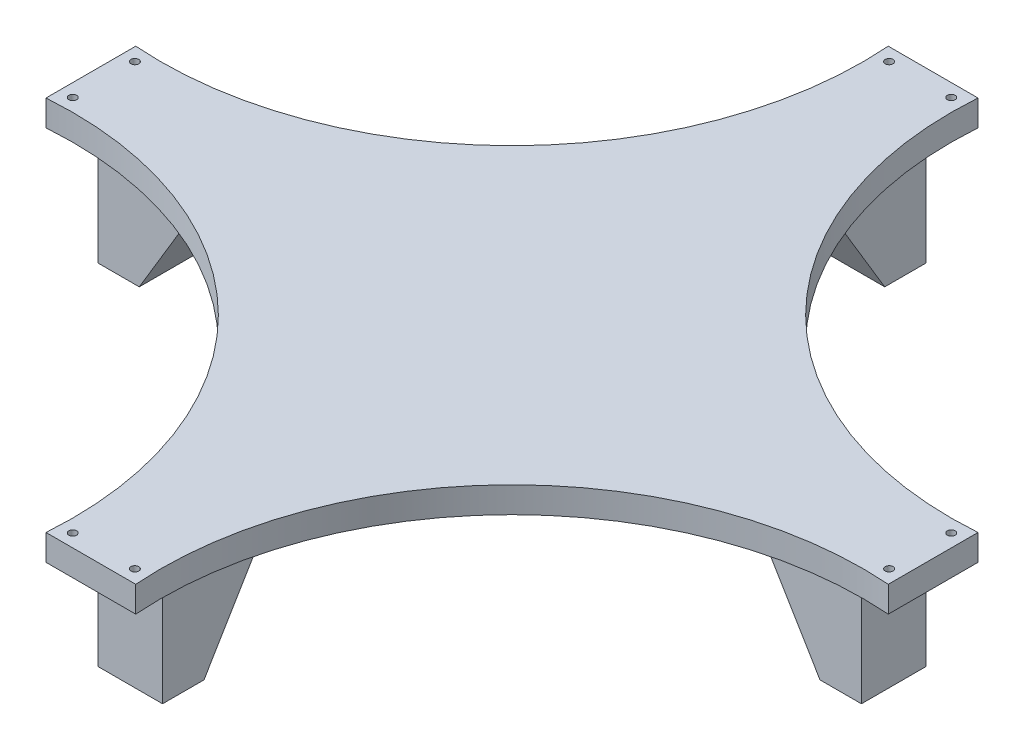
ISO-10303-21;
HEADER;
FILE_DESCRIPTION(('STEP AP214'),'2;1');
FILE_NAME('part.step','',(''),(''),'','','');
FILE_SCHEMA(('AUTOMOTIVE_DESIGN { 1 0 10303 214 1 1 1 1 }'));
ENDSEC;
DATA;
#1=APPLICATION_CONTEXT('core data for automotive mechanical design processes');
#2=APPLICATION_PROTOCOL_DEFINITION('international standard','automotive_design',2000,#1);
#3=PRODUCT_CONTEXT('',#1,'mechanical');
#4=PRODUCT('Part','Part','',(#3));
#5=PRODUCT_RELATED_PRODUCT_CATEGORY('part','',(#4));
#6=PRODUCT_DEFINITION_FORMATION('','',#4);
#7=PRODUCT_DEFINITION_CONTEXT('part definition',#1,'design');
#8=PRODUCT_DEFINITION('design','',#6,#7);
#9=PRODUCT_DEFINITION_SHAPE('','',#8);
#10=(LENGTH_UNIT() NAMED_UNIT(*) SI_UNIT(.MILLI.,.METRE.));
#11=(NAMED_UNIT(*) PLANE_ANGLE_UNIT() SI_UNIT($,.RADIAN.));
#12=(NAMED_UNIT(*) SI_UNIT($,.STERADIAN.) SOLID_ANGLE_UNIT());
#13=UNCERTAINTY_MEASURE_WITH_UNIT(LENGTH_MEASURE(1.E-05),#10,'distance_accuracy_value','');
#14=(GEOMETRIC_REPRESENTATION_CONTEXT(3) GLOBAL_UNCERTAINTY_ASSIGNED_CONTEXT((#13)) GLOBAL_UNIT_ASSIGNED_CONTEXT((#10,
#11,#12)) REPRESENTATION_CONTEXT('',''));
#15=CARTESIAN_POINT('',(0.,0.,0.));
#16=DIRECTION('',(0.,0.,1.));
#17=DIRECTION('',(1.,0.,0.));
#18=AXIS2_PLACEMENT_3D('',#15,#16,#17);
#19=CARTESIAN_POINT('',(0.,0.,0.));
#20=DIRECTION('',(0.,1.,0.));
#21=DIRECTION('',(0.,0.,1.));
#22=AXIS2_PLACEMENT_3D('',#19,#20,#21);
#23=PLANE('',#22);
#24=CARTESIAN_POINT('',(152.66,0.,-152.66));
#25=DIRECTION('',(0.,1.,0.));
#26=DIRECTION('',(0.,0.,1.));
#27=AXIS2_PLACEMENT_3D('',#24,#25,#26);
#28=CIRCLE('',#27,135.7);
#29=CARTESIAN_POINT('',(17.3289614316065,0.,-162.66));
#30=VERTEX_POINT('',#29);
#31=CARTESIAN_POINT('',(162.66,0.,-17.3289614316065));
#32=VERTEX_POINT('',#31);
#33=EDGE_CURVE('E354',#30,#32,#28,.T.);
#34=ORIENTED_EDGE('',*,*,#33,.T.);
#35=DIRECTION('',(0.,0.,1.));
#36=VECTOR('',#35,1.);
#37=CARTESIAN_POINT('',(162.66,0.,0.));
#38=LINE('',#37,#36);
#39=CARTESIAN_POINT('',(162.66,0.,17.3289614316066));
#40=VERTEX_POINT('',#39);
#41=EDGE_CURVE('E285',#32,#40,#38,.T.);
#42=ORIENTED_EDGE('',*,*,#41,.T.);
#43=CARTESIAN_POINT('',(152.66,0.,152.66));
#44=DIRECTION('',(0.,1.,0.));
#45=DIRECTION('',(0.,0.,1.));
#46=AXIS2_PLACEMENT_3D('',#43,#44,#45);
#47=CIRCLE('',#46,135.7);
#48=CARTESIAN_POINT('',(17.3289614316064,0.,162.66));
#49=VERTEX_POINT('',#48);
#50=EDGE_CURVE('E369',#40,#49,#47,.T.);
#51=ORIENTED_EDGE('',*,*,#50,.T.);
#52=DIRECTION('',(-1.,0.,0.));
#53=VECTOR('',#52,1.);
#54=CARTESIAN_POINT('',(0.,0.,162.66));
#55=LINE('',#54,#53);
#56=CARTESIAN_POINT('',(-17.3289614316066,0.,162.66));
#57=VERTEX_POINT('',#56);
#58=EDGE_CURVE('E366',#49,#57,#55,.T.);
#59=ORIENTED_EDGE('',*,*,#58,.T.);
#60=CARTESIAN_POINT('',(-152.66,0.,152.66));
#61=DIRECTION('',(0.,1.,0.));
#62=DIRECTION('',(0.,0.,1.));
#63=AXIS2_PLACEMENT_3D('',#60,#61,#62);
#64=CIRCLE('',#63,135.7);
#65=CARTESIAN_POINT('',(-162.66,0.,17.3289614316065));
#66=VERTEX_POINT('',#65);
#67=EDGE_CURVE('E364',#57,#66,#64,.T.);
#68=ORIENTED_EDGE('',*,*,#67,.T.);
#69=DIRECTION('',(0.,0.,-1.));
#70=VECTOR('',#69,1.);
#71=CARTESIAN_POINT('',(-162.66,0.,0.));
#72=LINE('',#71,#70);
#73=CARTESIAN_POINT('',(-162.66,0.,-17.3289614316065));
#74=VERTEX_POINT('',#73);
#75=EDGE_CURVE('E361',#66,#74,#72,.T.);
#76=ORIENTED_EDGE('',*,*,#75,.T.);
#77=CARTESIAN_POINT('',(-152.66,0.,-152.66));
#78=DIRECTION('',(0.,1.,0.));
#79=DIRECTION('',(0.,0.,1.));
#80=AXIS2_PLACEMENT_3D('',#77,#78,#79);
#81=CIRCLE('',#80,135.7);
#82=CARTESIAN_POINT('',(-17.3289614316066,0.,-162.66));
#83=VERTEX_POINT('',#82);
#84=EDGE_CURVE('E359',#74,#83,#81,.T.);
#85=ORIENTED_EDGE('',*,*,#84,.T.);
#86=DIRECTION('',(1.,0.,0.));
#87=VECTOR('',#86,1.);
#88=CARTESIAN_POINT('',(0.,0.,-162.66));
#89=LINE('',#88,#87);
#90=EDGE_CURVE('E356',#83,#30,#89,.T.);
#91=ORIENTED_EDGE('',*,*,#90,.T.);
#92=EDGE_LOOP('',(#34,#42,#51,#59,#68,#76,#85,#91));
#93=FACE_BOUND('',#92,.T.);
#94=DIRECTION('',(-1.,0.,0.));
#95=VECTOR('',#94,1.);
#96=CARTESIAN_POINT('',(0.,0.,-107.465698486706));
#97=LINE('',#96,#95);
#98=CARTESIAN_POINT('',(12.5000000000138,0.,-107.465698486716));
#99=VERTEX_POINT('',#98);
#100=CARTESIAN_POINT('',(-12.5000000000003,0.,-107.465698486716));
#101=VERTEX_POINT('',#100);
#102=EDGE_CURVE('E195',#99,#101,#97,.T.);
#103=ORIENTED_EDGE('',*,*,#102,.F.);
#104=DIRECTION('',(0.,0.,1.));
#105=VECTOR('',#104,1.);
#106=CARTESIAN_POINT('',(12.5000000000137,0.,0.));
#107=LINE('',#106,#105);
#108=CARTESIAN_POINT('',(12.5000000000138,0.,-147.465698486706));
#109=VERTEX_POINT('',#108);
#110=EDGE_CURVE('E204',#109,#99,#107,.T.);
#111=ORIENTED_EDGE('',*,*,#110,.F.);
#112=DIRECTION('',(-1.,0.,0.));
#113=VECTOR('',#112,1.);
#114=CARTESIAN_POINT('',(0.,0.,-147.465698486706));
#115=LINE('',#114,#113);
#116=CARTESIAN_POINT('',(-12.4999999999862,0.,-147.465698486706));
#117=VERTEX_POINT('',#116);
#118=EDGE_CURVE('E218',#109,#117,#115,.T.);
#119=ORIENTED_EDGE('',*,*,#118,.T.);
#120=DIRECTION('',(0.,0.,1.));
#121=VECTOR('',#120,1.);
#122=CARTESIAN_POINT('',(-12.4999999999863,0.,0.));
#123=LINE('',#122,#121);
#124=EDGE_CURVE('E203',#117,#101,#123,.T.);
#125=ORIENTED_EDGE('',*,*,#124,.T.);
#126=EDGE_LOOP('',(#103,#111,#119,#125));
#127=FACE_BOUND('',#126,.T.);
#128=DIRECTION('',(0.,0.,1.));
#129=VECTOR('',#128,1.);
#130=CARTESIAN_POINT('',(-107.465698486716,0.,0.));
#131=LINE('',#130,#129);
#132=CARTESIAN_POINT('',(-107.465698486716,0.,-12.5));
#133=VERTEX_POINT('',#132);
#134=CARTESIAN_POINT('',(-107.465698486716,0.,12.4999999999999));
#135=VERTEX_POINT('',#134);
#136=EDGE_CURVE('E430',#133,#135,#131,.T.);
#137=ORIENTED_EDGE('',*,*,#136,.F.);
#138=DIRECTION('',(1.,0.,0.));
#139=VECTOR('',#138,1.);
#140=CARTESIAN_POINT('',(0.,0.,-12.5));
#141=LINE('',#140,#139);
#142=CARTESIAN_POINT('',(-147.465698486716,0.,-12.5));
#143=VERTEX_POINT('',#142);
#144=EDGE_CURVE('E432',#143,#133,#141,.T.);
#145=ORIENTED_EDGE('',*,*,#144,.F.);
#146=DIRECTION('',(0.,0.,1.));
#147=VECTOR('',#146,1.);
#148=CARTESIAN_POINT('',(-147.465698486716,0.,0.));
#149=LINE('',#148,#147);
#150=CARTESIAN_POINT('',(-147.465698486716,0.,12.5));
#151=VERTEX_POINT('',#150);
#152=EDGE_CURVE('E424',#143,#151,#149,.T.);
#153=ORIENTED_EDGE('',*,*,#152,.T.);
#154=DIRECTION('',(1.,0.,0.));
#155=VECTOR('',#154,1.);
#156=CARTESIAN_POINT('',(0.,0.,12.5));
#157=LINE('',#156,#155);
#158=EDGE_CURVE('E427',#151,#135,#157,.T.);
#159=ORIENTED_EDGE('',*,*,#158,.T.);
#160=EDGE_LOOP('',(#137,#145,#153,#159));
#161=FACE_BOUND('',#160,.T.);
#162=DIRECTION('',(1.,0.,0.));
#163=VECTOR('',#162,1.);
#164=CARTESIAN_POINT('',(0.,0.,107.46569848673));
#165=LINE('',#164,#163);
#166=CARTESIAN_POINT('',(-12.5000000000107,0.,107.465698486716));
#167=VERTEX_POINT('',#166);
#168=CARTESIAN_POINT('',(12.500000000001,0.,107.465698486716));
#169=VERTEX_POINT('',#168);
#170=EDGE_CURVE('E269',#167,#169,#165,.T.);
#171=ORIENTED_EDGE('',*,*,#170,.F.);
#172=DIRECTION('',(0.,0.,-1.));
#173=VECTOR('',#172,1.);
#174=CARTESIAN_POINT('',(-12.5000000000107,0.,0.));
#175=LINE('',#174,#173);
#176=CARTESIAN_POINT('',(-12.5000000000107,0.,147.46569848673));
#177=VERTEX_POINT('',#176);
#178=EDGE_CURVE('E255',#177,#167,#175,.T.);
#179=ORIENTED_EDGE('',*,*,#178,.F.);
#180=DIRECTION('',(1.,0.,0.));
#181=VECTOR('',#180,1.);
#182=CARTESIAN_POINT('',(0.,0.,147.46569848673));
#183=LINE('',#182,#181);
#184=CARTESIAN_POINT('',(12.4999999999893,0.,147.46569848673));
#185=VERTEX_POINT('',#184);
#186=EDGE_CURVE('E260',#177,#185,#183,.T.);
#187=ORIENTED_EDGE('',*,*,#186,.T.);
#188=DIRECTION('',(0.,0.,-1.));
#189=VECTOR('',#188,1.);
#190=CARTESIAN_POINT('',(12.4999999999893,0.,0.));
#191=LINE('',#190,#189);
#192=EDGE_CURVE('E271',#185,#169,#191,.T.);
#193=ORIENTED_EDGE('',*,*,#192,.T.);
#194=EDGE_LOOP('',(#171,#179,#187,#193));
#195=FACE_BOUND('',#194,.T.);
#196=DIRECTION('',(-1.,0.,0.));
#197=VECTOR('',#196,1.);
#198=CARTESIAN_POINT('',(0.,0.,-12.4999999999999));
#199=LINE('',#198,#197);
#200=CARTESIAN_POINT('',(147.465698486716,0.,-12.4999999999999));
#201=VERTEX_POINT('',#200);
#202=CARTESIAN_POINT('',(107.465698486716,0.,-12.4999999999999));
#203=VERTEX_POINT('',#202);
#204=EDGE_CURVE('E242',#201,#203,#199,.T.);
#205=ORIENTED_EDGE('',*,*,#204,.T.);
#206=DIRECTION('',(0.,0.,1.));
#207=VECTOR('',#206,1.);
#208=CARTESIAN_POINT('',(107.465698486716,0.,0.));
#209=LINE('',#208,#207);
#210=CARTESIAN_POINT('',(107.465698486716,0.,12.5000000000001));
#211=VERTEX_POINT('',#210);
#212=EDGE_CURVE('E229',#203,#211,#209,.T.);
#213=ORIENTED_EDGE('',*,*,#212,.T.);
#214=DIRECTION('',(-1.,0.,0.));
#215=VECTOR('',#214,1.);
#216=CARTESIAN_POINT('',(0.,0.,12.5000000000001));
#217=LINE('',#216,#215);
#218=CARTESIAN_POINT('',(147.465698486716,0.,12.5000000000001));
#219=VERTEX_POINT('',#218);
#220=EDGE_CURVE('E234',#219,#211,#217,.T.);
#221=ORIENTED_EDGE('',*,*,#220,.F.);
#222=DIRECTION('',(0.,0.,1.));
#223=VECTOR('',#222,1.);
#224=CARTESIAN_POINT('',(147.465698486716,0.,0.));
#225=LINE('',#224,#223);
#226=EDGE_CURVE('E245',#201,#219,#225,.T.);
#227=ORIENTED_EDGE('',*,*,#226,.F.);
#228=EDGE_LOOP('',(#205,#213,#221,#227));
#229=FACE_BOUND('',#228,.T.);
#230=CARTESIAN_POINT('',(-12.0000000000001,0.,157.66));
#231=DIRECTION('',(0.,1.,0.));
#232=DIRECTION('',(0.,0.,1.));
#233=AXIS2_PLACEMENT_3D('',#230,#231,#232);
#234=CIRCLE('',#233,1.5);
#235=CARTESIAN_POINT('',(-12.0000000000001,0.,159.16));
#236=VERTEX_POINT('',#235);
#237=EDGE_CURVE('E351',#236,#236,#234,.T.);
#238=ORIENTED_EDGE('',*,*,#237,.T.);
#239=EDGE_LOOP('',(#238));
#240=FACE_BOUND('',#239,.T.);
#241=CARTESIAN_POINT('',(11.9999999999999,0.,157.66));
#242=DIRECTION('',(0.,1.,0.));
#243=DIRECTION('',(0.,0.,1.));
#244=AXIS2_PLACEMENT_3D('',#241,#242,#243);
#245=CIRCLE('',#244,1.5);
#246=CARTESIAN_POINT('',(11.9999999999999,0.,159.16));
#247=VERTEX_POINT('',#246);
#248=EDGE_CURVE('E348',#247,#247,#245,.T.);
#249=ORIENTED_EDGE('',*,*,#248,.T.);
#250=EDGE_LOOP('',(#249));
#251=FACE_BOUND('',#250,.T.);
#252=CARTESIAN_POINT('',(-157.66,0.,-12.0000000000007));
#253=DIRECTION('',(0.,1.,0.));
#254=DIRECTION('',(0.,0.,1.));
#255=AXIS2_PLACEMENT_3D('',#252,#253,#254);
#256=CIRCLE('',#255,1.5);
#257=CARTESIAN_POINT('',(-157.66,0.,-10.5000000000007));
#258=VERTEX_POINT('',#257);
#259=EDGE_CURVE('E345',#258,#258,#256,.T.);
#260=ORIENTED_EDGE('',*,*,#259,.T.);
#261=EDGE_LOOP('',(#260));
#262=FACE_BOUND('',#261,.T.);
#263=CARTESIAN_POINT('',(-157.66,0.,11.9999999999993));
#264=DIRECTION('',(0.,1.,0.));
#265=DIRECTION('',(0.,0.,1.));
#266=AXIS2_PLACEMENT_3D('',#263,#264,#265);
#267=CIRCLE('',#266,1.5);
#268=CARTESIAN_POINT('',(-157.66,0.,13.4999999999993));
#269=VERTEX_POINT('',#268);
#270=EDGE_CURVE('E342',#269,#269,#267,.T.);
#271=ORIENTED_EDGE('',*,*,#270,.T.);
#272=EDGE_LOOP('',(#271));
#273=FACE_BOUND('',#272,.T.);
#274=CARTESIAN_POINT('',(12.0000000000012,0.,-157.66));
#275=DIRECTION('',(0.,1.,0.));
#276=DIRECTION('',(0.,0.,1.));
#277=AXIS2_PLACEMENT_3D('',#274,#275,#276);
#278=CIRCLE('',#277,1.50000000000001);
#279=CARTESIAN_POINT('',(12.0000000000012,0.,-156.16));
#280=VERTEX_POINT('',#279);
#281=EDGE_CURVE('E339',#280,#280,#278,.T.);
#282=ORIENTED_EDGE('',*,*,#281,.T.);
#283=EDGE_LOOP('',(#282));
#284=FACE_BOUND('',#283,.T.);
#285=CARTESIAN_POINT('',(-11.9999999999988,0.,-157.66));
#286=DIRECTION('',(0.,1.,0.));
#287=DIRECTION('',(0.,0.,1.));
#288=AXIS2_PLACEMENT_3D('',#285,#286,#287);
#289=CIRCLE('',#288,1.50000000000001);
#290=CARTESIAN_POINT('',(-11.9999999999988,0.,-156.16));
#291=VERTEX_POINT('',#290);
#292=EDGE_CURVE('E336',#291,#291,#289,.T.);
#293=ORIENTED_EDGE('',*,*,#292,.T.);
#294=EDGE_LOOP('',(#293));
#295=FACE_BOUND('',#294,.T.);
#296=CARTESIAN_POINT('',(157.66,0.,12.0000000000017));
#297=DIRECTION('',(0.,1.,0.));
#298=DIRECTION('',(0.,0.,1.));
#299=AXIS2_PLACEMENT_3D('',#296,#297,#298);
#300=CIRCLE('',#299,1.5);
#301=CARTESIAN_POINT('',(157.66,0.,13.5000000000017));
#302=VERTEX_POINT('',#301);
#303=EDGE_CURVE('E333',#302,#302,#300,.T.);
#304=ORIENTED_EDGE('',*,*,#303,.T.);
#305=EDGE_LOOP('',(#304));
#306=FACE_BOUND('',#305,.T.);
#307=CARTESIAN_POINT('',(157.66,0.,-11.9999999999983));
#308=DIRECTION('',(0.,1.,0.));
#309=DIRECTION('',(0.,0.,1.));
#310=AXIS2_PLACEMENT_3D('',#307,#308,#309);
#311=CIRCLE('',#310,1.50000000000001);
#312=CARTESIAN_POINT('',(157.66,0.,-10.4999999999983));
#313=VERTEX_POINT('',#312);
#314=EDGE_CURVE('E280',#313,#313,#311,.T.);
#315=ORIENTED_EDGE('',*,*,#314,.T.);
#316=EDGE_LOOP('',(#315));
#317=FACE_BOUND('',#316,.T.);
#318=ADVANCED_FACE('F37',(#93,#127,#161,#195,#229,#240,#251,#262,#273,#284,#295,#306,#317),#23,.F.);
#319=CARTESIAN_POINT('',(152.66,10.,-152.66));
#320=DIRECTION('',(0.,-1.,0.));
#321=DIRECTION('',(0.,0.,-1.));
#322=AXIS2_PLACEMENT_3D('',#319,#320,#321);
#323=CYLINDRICAL_SURFACE('',#322,135.7);
#324=ORIENTED_EDGE('',*,*,#33,.F.);
#325=DIRECTION('',(0.,-1.,0.));
#326=VECTOR('',#325,1.);
#327=CARTESIAN_POINT('',(17.3289614316065,10.,-162.66));
#328=LINE('',#327,#326);
#329=CARTESIAN_POINT('',(17.3289614316065,10.,-162.66));
#330=VERTEX_POINT('',#329);
#331=EDGE_CURVE('E390',#330,#30,#328,.T.);
#332=ORIENTED_EDGE('',*,*,#331,.F.);
#333=CARTESIAN_POINT('',(152.66,10.,-152.66));
#334=DIRECTION('',(0.,1.,0.));
#335=DIRECTION('',(0.,0.,1.));
#336=AXIS2_PLACEMENT_3D('',#333,#334,#335);
#337=CIRCLE('',#336,135.7);
#338=CARTESIAN_POINT('',(162.66,10.,-17.3289614316065));
#339=VERTEX_POINT('',#338);
#340=EDGE_CURVE('E306',#330,#339,#337,.T.);
#341=ORIENTED_EDGE('',*,*,#340,.T.);
#342=DIRECTION('',(0.,-1.,0.));
#343=VECTOR('',#342,1.);
#344=CARTESIAN_POINT('',(162.66,10.,-17.3289614316065));
#345=LINE('',#344,#343);
#346=EDGE_CURVE('E330',#339,#32,#345,.T.);
#347=ORIENTED_EDGE('',*,*,#346,.T.);
#348=EDGE_LOOP('',(#324,#332,#341,#347));
#349=FACE_BOUND('',#348,.T.);
#350=ADVANCED_FACE('F473',(#349),#323,.F.);
#351=CARTESIAN_POINT('',(0.,10.,-162.66));
#352=DIRECTION('',(0.,0.,-1.));
#353=DIRECTION('',(-1.,0.,0.));
#354=AXIS2_PLACEMENT_3D('',#351,#352,#353);
#355=PLANE('',#354);
#356=ORIENTED_EDGE('',*,*,#90,.F.);
#357=DIRECTION('',(0.,-1.,0.));
#358=VECTOR('',#357,1.);
#359=CARTESIAN_POINT('',(-17.3289614316066,10.,-162.66));
#360=LINE('',#359,#358);
#361=CARTESIAN_POINT('',(-17.3289614316066,10.,-162.66));
#362=VERTEX_POINT('',#361);
#363=EDGE_CURVE('E387',#362,#83,#360,.T.);
#364=ORIENTED_EDGE('',*,*,#363,.F.);
#365=DIRECTION('',(1.,0.,0.));
#366=VECTOR('',#365,1.);
#367=CARTESIAN_POINT('',(0.,10.,-162.66));
#368=LINE('',#367,#366);
#369=EDGE_CURVE('E309',#362,#330,#368,.T.);
#370=ORIENTED_EDGE('',*,*,#369,.T.);
#371=ORIENTED_EDGE('',*,*,#331,.T.);
#372=EDGE_LOOP('',(#356,#364,#370,#371));
#373=FACE_BOUND('',#372,.T.);
#374=ADVANCED_FACE('F480',(#373),#355,.T.);
#375=CARTESIAN_POINT('',(-152.66,10.,-152.66));
#376=DIRECTION('',(0.,-1.,0.));
#377=DIRECTION('',(0.,0.,-1.));
#378=AXIS2_PLACEMENT_3D('',#375,#376,#377);
#379=CYLINDRICAL_SURFACE('',#378,135.7);
#380=ORIENTED_EDGE('',*,*,#84,.F.);
#381=DIRECTION('',(0.,-1.,0.));
#382=VECTOR('',#381,1.);
#383=CARTESIAN_POINT('',(-162.66,10.,-17.3289614316065));
#384=LINE('',#383,#382);
#385=CARTESIAN_POINT('',(-162.66,10.,-17.3289614316065));
#386=VERTEX_POINT('',#385);
#387=EDGE_CURVE('E385',#386,#74,#384,.T.);
#388=ORIENTED_EDGE('',*,*,#387,.F.);
#389=CARTESIAN_POINT('',(-152.66,10.,-152.66));
#390=DIRECTION('',(0.,1.,0.));
#391=DIRECTION('',(0.,0.,1.));
#392=AXIS2_PLACEMENT_3D('',#389,#390,#391);
#393=CIRCLE('',#392,135.7);
#394=EDGE_CURVE('E312',#386,#362,#393,.T.);
#395=ORIENTED_EDGE('',*,*,#394,.T.);
#396=ORIENTED_EDGE('',*,*,#363,.T.);
#397=EDGE_LOOP('',(#380,#388,#395,#396));
#398=FACE_BOUND('',#397,.T.);
#399=ADVANCED_FACE('F507',(#398),#379,.F.);
#400=CARTESIAN_POINT('',(-162.66,10.,0.));
#401=DIRECTION('',(-1.,0.,0.));
#402=DIRECTION('',(0.,0.,1.));
#403=AXIS2_PLACEMENT_3D('',#400,#401,#402);
#404=PLANE('',#403);
#405=ORIENTED_EDGE('',*,*,#75,.F.);
#406=DIRECTION('',(0.,-1.,0.));
#407=VECTOR('',#406,1.);
#408=CARTESIAN_POINT('',(-162.66,10.,17.3289614316065));
#409=LINE('',#408,#407);
#410=CARTESIAN_POINT('',(-162.66,10.,17.3289614316065));
#411=VERTEX_POINT('',#410);
#412=EDGE_CURVE('E382',#411,#66,#409,.T.);
#413=ORIENTED_EDGE('',*,*,#412,.F.);
#414=DIRECTION('',(0.,0.,-1.));
#415=VECTOR('',#414,1.);
#416=CARTESIAN_POINT('',(-162.66,10.,0.));
#417=LINE('',#416,#415);
#418=EDGE_CURVE('E315',#411,#386,#417,.T.);
#419=ORIENTED_EDGE('',*,*,#418,.T.);
#420=ORIENTED_EDGE('',*,*,#387,.T.);
#421=EDGE_LOOP('',(#405,#413,#419,#420));
#422=FACE_BOUND('',#421,.T.);
#423=ADVANCED_FACE('F503',(#422),#404,.T.);
#424=CARTESIAN_POINT('',(-152.66,10.,152.66));
#425=DIRECTION('',(0.,-1.,0.));
#426=DIRECTION('',(0.,0.,-1.));
#427=AXIS2_PLACEMENT_3D('',#424,#425,#426);
#428=CYLINDRICAL_SURFACE('',#427,135.7);
#429=ORIENTED_EDGE('',*,*,#67,.F.);
#430=DIRECTION('',(0.,-1.,0.));
#431=VECTOR('',#430,1.);
#432=CARTESIAN_POINT('',(-17.3289614316066,10.,162.66));
#433=LINE('',#432,#431);
#434=CARTESIAN_POINT('',(-17.3289614316066,10.,162.66));
#435=VERTEX_POINT('',#434);
#436=EDGE_CURVE('E380',#435,#57,#433,.T.);
#437=ORIENTED_EDGE('',*,*,#436,.F.);
#438=CARTESIAN_POINT('',(-152.66,10.,152.66));
#439=DIRECTION('',(0.,1.,0.));
#440=DIRECTION('',(0.,0.,1.));
#441=AXIS2_PLACEMENT_3D('',#438,#439,#440);
#442=CIRCLE('',#441,135.7);
#443=EDGE_CURVE('E318',#435,#411,#442,.T.);
#444=ORIENTED_EDGE('',*,*,#443,.T.);
#445=ORIENTED_EDGE('',*,*,#412,.T.);
#446=EDGE_LOOP('',(#429,#437,#444,#445));
#447=FACE_BOUND('',#446,.T.);
#448=ADVANCED_FACE('F499',(#447),#428,.F.);
#449=CARTESIAN_POINT('',(0.,10.,162.66));
#450=DIRECTION('',(0.,0.,1.));
#451=DIRECTION('',(1.,0.,0.));
#452=AXIS2_PLACEMENT_3D('',#449,#450,#451);
#453=PLANE('',#452);
#454=ORIENTED_EDGE('',*,*,#58,.F.);
#455=DIRECTION('',(0.,-1.,0.));
#456=VECTOR('',#455,1.);
#457=CARTESIAN_POINT('',(17.3289614316064,10.,162.66));
#458=LINE('',#457,#456);
#459=CARTESIAN_POINT('',(17.3289614316064,10.,162.66));
#460=VERTEX_POINT('',#459);
#461=EDGE_CURVE('E377',#460,#49,#458,.T.);
#462=ORIENTED_EDGE('',*,*,#461,.F.);
#463=DIRECTION('',(-1.,0.,0.));
#464=VECTOR('',#463,1.);
#465=CARTESIAN_POINT('',(0.,10.,162.66));
#466=LINE('',#465,#464);
#467=EDGE_CURVE('E321',#460,#435,#466,.T.);
#468=ORIENTED_EDGE('',*,*,#467,.T.);
#469=ORIENTED_EDGE('',*,*,#436,.T.);
#470=EDGE_LOOP('',(#454,#462,#468,#469));
#471=FACE_BOUND('',#470,.T.);
#472=ADVANCED_FACE('F495',(#471),#453,.T.);
#473=CARTESIAN_POINT('',(152.66,10.,152.66));
#474=DIRECTION('',(0.,-1.,0.));
#475=DIRECTION('',(0.,0.,-1.));
#476=AXIS2_PLACEMENT_3D('',#473,#474,#475);
#477=CYLINDRICAL_SURFACE('',#476,135.7);
#478=ORIENTED_EDGE('',*,*,#50,.F.);
#479=DIRECTION('',(0.,-1.,0.));
#480=VECTOR('',#479,1.);
#481=CARTESIAN_POINT('',(162.66,10.,17.3289614316066));
#482=LINE('',#481,#480);
#483=CARTESIAN_POINT('',(162.66,10.,17.3289614316066));
#484=VERTEX_POINT('',#483);
#485=EDGE_CURVE('E375',#484,#40,#482,.T.);
#486=ORIENTED_EDGE('',*,*,#485,.F.);
#487=CARTESIAN_POINT('',(152.66,10.,152.66));
#488=DIRECTION('',(0.,1.,0.));
#489=DIRECTION('',(0.,0.,1.));
#490=AXIS2_PLACEMENT_3D('',#487,#488,#489);
#491=CIRCLE('',#490,135.7);
#492=EDGE_CURVE('E324',#484,#460,#491,.T.);
#493=ORIENTED_EDGE('',*,*,#492,.T.);
#494=ORIENTED_EDGE('',*,*,#461,.T.);
#495=EDGE_LOOP('',(#478,#486,#493,#494));
#496=FACE_BOUND('',#495,.T.);
#497=ADVANCED_FACE('F491',(#496),#477,.F.);
#498=CARTESIAN_POINT('',(-12.0000000000001,10.,157.66));
#499=DIRECTION('',(0.,-1.,0.));
#500=DIRECTION('',(0.,0.,-1.));
#501=AXIS2_PLACEMENT_3D('',#498,#499,#500);
#502=CYLINDRICAL_SURFACE('',#501,1.5);
#503=CARTESIAN_POINT('',(-12.0000000000001,10.,157.66));
#504=DIRECTION('',(0.,1.,0.));
#505=DIRECTION('',(0.,0.,1.));
#506=AXIS2_PLACEMENT_3D('',#503,#504,#505);
#507=CIRCLE('',#506,1.5);
#508=CARTESIAN_POINT('',(-12.0000000000001,10.,159.16));
#509=VERTEX_POINT('',#508);
#510=EDGE_CURVE('E303',#509,#509,#507,.T.);
#511=ORIENTED_EDGE('',*,*,#510,.T.);
#512=EDGE_LOOP('',(#511));
#513=FACE_BOUND('',#512,.T.);
#514=ORIENTED_EDGE('',*,*,#237,.F.);
#515=EDGE_LOOP('',(#514));
#516=FACE_BOUND('',#515,.T.);
#517=ADVANCED_FACE('F494',(#513,#516),#502,.F.);
#518=CARTESIAN_POINT('',(11.9999999999999,10.,157.66));
#519=DIRECTION('',(0.,-1.,0.));
#520=DIRECTION('',(0.,0.,-1.));
#521=AXIS2_PLACEMENT_3D('',#518,#519,#520);
#522=CYLINDRICAL_SURFACE('',#521,1.5);
#523=CARTESIAN_POINT('',(11.9999999999999,10.,157.66));
#524=DIRECTION('',(0.,1.,0.));
#525=DIRECTION('',(0.,0.,1.));
#526=AXIS2_PLACEMENT_3D('',#523,#524,#525);
#527=CIRCLE('',#526,1.5);
#528=CARTESIAN_POINT('',(11.9999999999999,10.,159.16));
#529=VERTEX_POINT('',#528);
#530=EDGE_CURVE('E300',#529,#529,#527,.T.);
#531=ORIENTED_EDGE('',*,*,#530,.T.);
#532=EDGE_LOOP('',(#531));
#533=FACE_BOUND('',#532,.T.);
#534=ORIENTED_EDGE('',*,*,#248,.F.);
#535=EDGE_LOOP('',(#534));
#536=FACE_BOUND('',#535,.T.);
#537=ADVANCED_FACE('F517',(#533,#536),#522,.F.);
#538=CARTESIAN_POINT('',(-157.66,10.,-12.0000000000007));
#539=DIRECTION('',(0.,-1.,0.));
#540=DIRECTION('',(0.,0.,-1.));
#541=AXIS2_PLACEMENT_3D('',#538,#539,#540);
#542=CYLINDRICAL_SURFACE('',#541,1.5);
#543=CARTESIAN_POINT('',(-157.66,10.,-12.0000000000007));
#544=DIRECTION('',(0.,1.,0.));
#545=DIRECTION('',(0.,0.,1.));
#546=AXIS2_PLACEMENT_3D('',#543,#544,#545);
#547=CIRCLE('',#546,1.5);
#548=CARTESIAN_POINT('',(-157.66,10.,-10.5000000000007));
#549=VERTEX_POINT('',#548);
#550=EDGE_CURVE('E297',#549,#549,#547,.T.);
#551=ORIENTED_EDGE('',*,*,#550,.T.);
#552=EDGE_LOOP('',(#551));
#553=FACE_BOUND('',#552,.T.);
#554=ORIENTED_EDGE('',*,*,#259,.F.);
#555=EDGE_LOOP('',(#554));
#556=FACE_BOUND('',#555,.T.);
#557=ADVANCED_FACE('F521',(#553,#556),#542,.F.);
#558=CARTESIAN_POINT('',(-157.66,10.,11.9999999999993));
#559=DIRECTION('',(0.,-1.,0.));
#560=DIRECTION('',(0.,0.,-1.));
#561=AXIS2_PLACEMENT_3D('',#558,#559,#560);
#562=CYLINDRICAL_SURFACE('',#561,1.5);
#563=CARTESIAN_POINT('',(-157.66,10.,11.9999999999993));
#564=DIRECTION('',(0.,1.,0.));
#565=DIRECTION('',(0.,0.,1.));
#566=AXIS2_PLACEMENT_3D('',#563,#564,#565);
#567=CIRCLE('',#566,1.5);
#568=CARTESIAN_POINT('',(-157.66,10.,13.4999999999993));
#569=VERTEX_POINT('',#568);
#570=EDGE_CURVE('E294',#569,#569,#567,.T.);
#571=ORIENTED_EDGE('',*,*,#570,.T.);
#572=EDGE_LOOP('',(#571));
#573=FACE_BOUND('',#572,.T.);
#574=ORIENTED_EDGE('',*,*,#270,.F.);
#575=EDGE_LOOP('',(#574));
#576=FACE_BOUND('',#575,.T.);
#577=ADVANCED_FACE('F525',(#573,#576),#562,.F.);
#578=CARTESIAN_POINT('',(12.0000000000012,10.,-157.66));
#579=DIRECTION('',(0.,-1.,0.));
#580=DIRECTION('',(0.,0.,-1.));
#581=AXIS2_PLACEMENT_3D('',#578,#579,#580);
#582=CYLINDRICAL_SURFACE('',#581,1.50000000000001);
#583=CARTESIAN_POINT('',(12.0000000000012,10.,-157.66));
#584=DIRECTION('',(0.,1.,0.));
#585=DIRECTION('',(0.,0.,1.));
#586=AXIS2_PLACEMENT_3D('',#583,#584,#585);
#587=CIRCLE('',#586,1.50000000000001);
#588=CARTESIAN_POINT('',(12.0000000000012,10.,-156.16));
#589=VERTEX_POINT('',#588);
#590=EDGE_CURVE('E291',#589,#589,#587,.T.);
#591=ORIENTED_EDGE('',*,*,#590,.T.);
#592=EDGE_LOOP('',(#591));
#593=FACE_BOUND('',#592,.T.);
#594=ORIENTED_EDGE('',*,*,#281,.F.);
#595=EDGE_LOOP('',(#594));
#596=FACE_BOUND('',#595,.T.);
#597=ADVANCED_FACE('F529',(#593,#596),#582,.F.);
#598=CARTESIAN_POINT('',(-11.9999999999988,10.,-157.66));
#599=DIRECTION('',(0.,-1.,0.));
#600=DIRECTION('',(0.,0.,-1.));
#601=AXIS2_PLACEMENT_3D('',#598,#599,#600);
#602=CYLINDRICAL_SURFACE('',#601,1.50000000000001);
#603=CARTESIAN_POINT('',(-11.9999999999988,10.,-157.66));
#604=DIRECTION('',(0.,1.,0.));
#605=DIRECTION('',(0.,0.,1.));
#606=AXIS2_PLACEMENT_3D('',#603,#604,#605);
#607=CIRCLE('',#606,1.50000000000001);
#608=CARTESIAN_POINT('',(-11.9999999999988,10.,-156.16));
#609=VERTEX_POINT('',#608);
#610=EDGE_CURVE('E288',#609,#609,#607,.T.);
#611=ORIENTED_EDGE('',*,*,#610,.T.);
#612=EDGE_LOOP('',(#611));
#613=FACE_BOUND('',#612,.T.);
#614=ORIENTED_EDGE('',*,*,#292,.F.);
#615=EDGE_LOOP('',(#614));
#616=FACE_BOUND('',#615,.T.);
#617=ADVANCED_FACE('F533',(#613,#616),#602,.F.);
#618=CARTESIAN_POINT('',(157.66,10.,12.0000000000017));
#619=DIRECTION('',(0.,-1.,0.));
#620=DIRECTION('',(0.,0.,-1.));
#621=AXIS2_PLACEMENT_3D('',#618,#619,#620);
#622=CYLINDRICAL_SURFACE('',#621,1.5);
#623=CARTESIAN_POINT('',(157.66,10.,12.0000000000017));
#624=DIRECTION('',(0.,1.,0.));
#625=DIRECTION('',(0.,0.,1.));
#626=AXIS2_PLACEMENT_3D('',#623,#624,#625);
#627=CIRCLE('',#626,1.5);
#628=CARTESIAN_POINT('',(157.66,10.,13.5000000000017));
#629=VERTEX_POINT('',#628);
#630=EDGE_CURVE('E284',#629,#629,#627,.T.);
#631=ORIENTED_EDGE('',*,*,#630,.T.);
#632=EDGE_LOOP('',(#631));
#633=FACE_BOUND('',#632,.T.);
#634=ORIENTED_EDGE('',*,*,#303,.F.);
#635=EDGE_LOOP('',(#634));
#636=FACE_BOUND('',#635,.T.);
#637=ADVANCED_FACE('F536',(#633,#636),#622,.F.);
#638=CARTESIAN_POINT('',(157.66,10.,-11.9999999999983));
#639=DIRECTION('',(0.,-1.,0.));
#640=DIRECTION('',(0.,0.,-1.));
#641=AXIS2_PLACEMENT_3D('',#638,#639,#640);
#642=CYLINDRICAL_SURFACE('',#641,1.50000000000001);
#643=CARTESIAN_POINT('',(157.66,10.,-11.9999999999983));
#644=DIRECTION('',(0.,1.,0.));
#645=DIRECTION('',(0.,0.,1.));
#646=AXIS2_PLACEMENT_3D('',#643,#644,#645);
#647=CIRCLE('',#646,1.50000000000001);
#648=CARTESIAN_POINT('',(157.66,10.,-10.4999999999983));
#649=VERTEX_POINT('',#648);
#650=EDGE_CURVE('E281',#649,#649,#647,.T.);
#651=ORIENTED_EDGE('',*,*,#650,.T.);
#652=EDGE_LOOP('',(#651));
#653=FACE_BOUND('',#652,.T.);
#654=ORIENTED_EDGE('',*,*,#314,.F.);
#655=EDGE_LOOP('',(#654));
#656=FACE_BOUND('',#655,.T.);
#657=ADVANCED_FACE('F39',(#653,#656),#642,.F.);
#658=CARTESIAN_POINT('',(162.66,10.,0.));
#659=DIRECTION('',(1.,0.,0.));
#660=DIRECTION('',(0.,0.,-1.));
#661=AXIS2_PLACEMENT_3D('',#658,#659,#660);
#662=PLANE('',#661);
#663=ORIENTED_EDGE('',*,*,#41,.F.);
#664=ORIENTED_EDGE('',*,*,#346,.F.);
#665=DIRECTION('',(0.,0.,1.));
#666=VECTOR('',#665,1.);
#667=CARTESIAN_POINT('',(162.66,10.,0.));
#668=LINE('',#667,#666);
#669=EDGE_CURVE('E327',#339,#484,#668,.T.);
#670=ORIENTED_EDGE('',*,*,#669,.T.);
#671=ORIENTED_EDGE('',*,*,#485,.T.);
#672=EDGE_LOOP('',(#663,#664,#670,#671));
#673=FACE_BOUND('',#672,.T.);
#674=ADVANCED_FACE('F487',(#673),#662,.T.);
#675=CARTESIAN_POINT('',(0.,10.,0.));
#676=DIRECTION('',(0.,1.,0.));
#677=DIRECTION('',(0.,0.,1.));
#678=AXIS2_PLACEMENT_3D('',#675,#676,#677);
#679=PLANE('',#678);
#680=ORIENTED_EDGE('',*,*,#650,.F.);
#681=EDGE_LOOP('',(#680));
#682=FACE_BOUND('',#681,.T.);
#683=ORIENTED_EDGE('',*,*,#630,.F.);
#684=EDGE_LOOP('',(#683));
#685=FACE_BOUND('',#684,.T.);
#686=ORIENTED_EDGE('',*,*,#610,.F.);
#687=EDGE_LOOP('',(#686));
#688=FACE_BOUND('',#687,.T.);
#689=ORIENTED_EDGE('',*,*,#590,.F.);
#690=EDGE_LOOP('',(#689));
#691=FACE_BOUND('',#690,.T.);
#692=ORIENTED_EDGE('',*,*,#570,.F.);
#693=EDGE_LOOP('',(#692));
#694=FACE_BOUND('',#693,.T.);
#695=ORIENTED_EDGE('',*,*,#550,.F.);
#696=EDGE_LOOP('',(#695));
#697=FACE_BOUND('',#696,.T.);
#698=ORIENTED_EDGE('',*,*,#530,.F.);
#699=EDGE_LOOP('',(#698));
#700=FACE_BOUND('',#699,.T.);
#701=ORIENTED_EDGE('',*,*,#510,.F.);
#702=EDGE_LOOP('',(#701));
#703=FACE_BOUND('',#702,.T.);
#704=ORIENTED_EDGE('',*,*,#340,.F.);
#705=ORIENTED_EDGE('',*,*,#369,.F.);
#706=ORIENTED_EDGE('',*,*,#394,.F.);
#707=ORIENTED_EDGE('',*,*,#418,.F.);
#708=ORIENTED_EDGE('',*,*,#443,.F.);
#709=ORIENTED_EDGE('',*,*,#467,.F.);
#710=ORIENTED_EDGE('',*,*,#492,.F.);
#711=ORIENTED_EDGE('',*,*,#669,.F.);
#712=EDGE_LOOP('',(#704,#705,#706,#707,#708,#709,#710,#711));
#713=FACE_BOUND('',#712,.T.);
#714=ADVANCED_FACE('F485',(#682,#685,#688,#691,#694,#697,#700,#703,#713),#679,.T.);
#715=CARTESIAN_POINT('',(-12.5000000000107,-40.,0.));
#716=DIRECTION('',(1.,0.,0.));
#717=DIRECTION('',(0.,0.,-1.));
#718=AXIS2_PLACEMENT_3D('',#715,#716,#717);
#719=PLANE('',#718);
#720=ORIENTED_EDGE('',*,*,#178,.T.);
#721=DIRECTION('',(0.,-0.857492925712544,0.514495755427527));
#722=VECTOR('',#721,1.);
#723=CARTESIAN_POINT('',(-12.5000000000107,17.9995728617867,96.6659547696444));
#724=LINE('',#723,#722);
#725=CARTESIAN_POINT('',(-12.5000000000107,-40.,131.465698486716));
#726=VERTEX_POINT('',#725);
#727=EDGE_CURVE('E401',#167,#726,#724,.T.);
#728=ORIENTED_EDGE('',*,*,#727,.T.);
#729=DIRECTION('',(0.,0.,-1.));
#730=VECTOR('',#729,1.);
#731=CARTESIAN_POINT('',(-12.5000000000107,-40.,0.));
#732=LINE('',#731,#730);
#733=CARTESIAN_POINT('',(-12.5000000000107,-40.,147.46569848673));
#734=VERTEX_POINT('',#733);
#735=EDGE_CURVE('E256',#734,#726,#732,.T.);
#736=ORIENTED_EDGE('',*,*,#735,.F.);
#737=DIRECTION('',(0.,1.,0.));
#738=VECTOR('',#737,1.);
#739=CARTESIAN_POINT('',(-12.5000000000107,-40.,147.46569848673));
#740=LINE('',#739,#738);
#741=EDGE_CURVE('E266',#734,#177,#740,.T.);
#742=ORIENTED_EDGE('',*,*,#741,.T.);
#743=EDGE_LOOP('',(#720,#728,#736,#742));
#744=FACE_BOUND('',#743,.T.);
#745=ADVANCED_FACE('F554',(#744),#719,.F.);
#746=CARTESIAN_POINT('',(12.4999999999893,-40.,0.));
#747=DIRECTION('',(1.,0.,0.));
#748=DIRECTION('',(0.,0.,-1.));
#749=AXIS2_PLACEMENT_3D('',#746,#747,#748);
#750=PLANE('',#749);
#751=DIRECTION('',(0.,-0.857492925712544,0.514495755427527));
#752=VECTOR('',#751,1.);
#753=CARTESIAN_POINT('',(12.5000000000013,-40.,131.465698486716));
#754=LINE('',#753,#752);
#755=CARTESIAN_POINT('',(12.4999999999893,-40.,131.465698486716));
#756=VERTEX_POINT('',#755);
#757=EDGE_CURVE('E51',#169,#756,#754,.T.);
#758=ORIENTED_EDGE('',*,*,#757,.F.);
#759=ORIENTED_EDGE('',*,*,#192,.F.);
#760=DIRECTION('',(0.,1.,0.));
#761=VECTOR('',#760,1.);
#762=CARTESIAN_POINT('',(12.4999999999893,-40.,147.46569848673));
#763=LINE('',#762,#761);
#764=CARTESIAN_POINT('',(12.4999999999893,-40.,147.46569848673));
#765=VERTEX_POINT('',#764);
#766=EDGE_CURVE('E277',#765,#185,#763,.T.);
#767=ORIENTED_EDGE('',*,*,#766,.F.);
#768=DIRECTION('',(0.,0.,-1.));
#769=VECTOR('',#768,1.);
#770=CARTESIAN_POINT('',(12.4999999999893,-40.,0.));
#771=LINE('',#770,#769);
#772=EDGE_CURVE('E259',#765,#756,#771,.T.);
#773=ORIENTED_EDGE('',*,*,#772,.T.);
#774=EDGE_LOOP('',(#758,#759,#767,#773));
#775=FACE_BOUND('',#774,.T.);
#776=ADVANCED_FACE('F606',(#775),#750,.T.);
#777=CARTESIAN_POINT('',(0.,-40.,147.46569848673));
#778=DIRECTION('',(0.,0.,1.));
#779=DIRECTION('',(1.,0.,0.));
#780=AXIS2_PLACEMENT_3D('',#777,#778,#779);
#781=PLANE('',#780);
#782=ORIENTED_EDGE('',*,*,#186,.F.);
#783=ORIENTED_EDGE('',*,*,#741,.F.);
#784=DIRECTION('',(1.,0.,0.));
#785=VECTOR('',#784,1.);
#786=CARTESIAN_POINT('',(0.,-40.,147.46569848673));
#787=LINE('',#786,#785);
#788=EDGE_CURVE('E263',#734,#765,#787,.T.);
#789=ORIENTED_EDGE('',*,*,#788,.T.);
#790=ORIENTED_EDGE('',*,*,#766,.T.);
#791=EDGE_LOOP('',(#782,#783,#789,#790));
#792=FACE_BOUND('',#791,.T.);
#793=ADVANCED_FACE('F612',(#792),#781,.T.);
#794=CARTESIAN_POINT('',(0.,-40.,0.));
#795=DIRECTION('',(0.,-1.,0.));
#796=DIRECTION('',(0.,0.,-1.));
#797=AXIS2_PLACEMENT_3D('',#794,#795,#796);
#798=PLANE('',#797);
#799=DIRECTION('',(-1.,0.,0.));
#800=VECTOR('',#799,1.);
#801=CARTESIAN_POINT('',(1.38843293056557E-12,-40.,131.465698486716));
#802=LINE('',#801,#800);
#803=EDGE_CURVE('E11',#756,#726,#802,.T.);
#804=ORIENTED_EDGE('',*,*,#803,.F.);
#805=ORIENTED_EDGE('',*,*,#772,.F.);
#806=ORIENTED_EDGE('',*,*,#788,.F.);
#807=ORIENTED_EDGE('',*,*,#735,.T.);
#808=EDGE_LOOP('',(#804,#805,#806,#807));
#809=FACE_BOUND('',#808,.T.);
#810=ADVANCED_FACE('F618',(#809),#798,.T.);
#811=CARTESIAN_POINT('',(0.,-40.,-12.4999999999999));
#812=DIRECTION('',(0.,0.,-1.));
#813=DIRECTION('',(-1.,0.,0.));
#814=AXIS2_PLACEMENT_3D('',#811,#812,#813);
#815=PLANE('',#814);
#816=DIRECTION('',(0.514495755427527,-0.857492925712544,0.));
#817=VECTOR('',#816,1.);
#818=CARTESIAN_POINT('',(131.465698486716,-40.,-12.4999999999999));
#819=LINE('',#818,#817);
#820=CARTESIAN_POINT('',(131.465698486716,-40.,-12.4999999999999));
#821=VERTEX_POINT('',#820);
#822=EDGE_CURVE('E441',#203,#821,#819,.T.);
#823=ORIENTED_EDGE('',*,*,#822,.F.);
#824=ORIENTED_EDGE('',*,*,#204,.F.);
#825=DIRECTION('',(0.,1.,0.));
#826=VECTOR('',#825,1.);
#827=CARTESIAN_POINT('',(147.465698486716,-40.,-12.4999999999999));
#828=LINE('',#827,#826);
#829=CARTESIAN_POINT('',(147.465698486716,-40.,-12.4999999999999));
#830=VERTEX_POINT('',#829);
#831=EDGE_CURVE('E252',#830,#201,#828,.T.);
#832=ORIENTED_EDGE('',*,*,#831,.F.);
#833=DIRECTION('',(-1.,0.,0.));
#834=VECTOR('',#833,1.);
#835=CARTESIAN_POINT('',(0.,-40.,-12.4999999999999));
#836=LINE('',#835,#834);
#837=EDGE_CURVE('E230',#830,#821,#836,.T.);
#838=ORIENTED_EDGE('',*,*,#837,.T.);
#839=EDGE_LOOP('',(#823,#824,#832,#838));
#840=FACE_BOUND('',#839,.T.);
#841=ADVANCED_FACE('F622',(#840),#815,.T.);
#842=CARTESIAN_POINT('',(147.465698486716,-40.,0.));
#843=DIRECTION('',(-1.,0.,0.));
#844=DIRECTION('',(0.,0.,1.));
#845=AXIS2_PLACEMENT_3D('',#842,#843,#844);
#846=PLANE('',#845);
#847=ORIENTED_EDGE('',*,*,#226,.T.);
#848=DIRECTION('',(0.,1.,0.));
#849=VECTOR('',#848,1.);
#850=CARTESIAN_POINT('',(147.465698486716,-40.,12.5000000000001));
#851=LINE('',#850,#849);
#852=CARTESIAN_POINT('',(147.465698486716,-40.,12.5000000000001));
#853=VERTEX_POINT('',#852);
#854=EDGE_CURVE('E239',#853,#219,#851,.T.);
#855=ORIENTED_EDGE('',*,*,#854,.F.);
#856=DIRECTION('',(0.,0.,1.));
#857=VECTOR('',#856,1.);
#858=CARTESIAN_POINT('',(147.465698486716,-40.,0.));
#859=LINE('',#858,#857);
#860=EDGE_CURVE('E233',#830,#853,#859,.T.);
#861=ORIENTED_EDGE('',*,*,#860,.F.);
#862=ORIENTED_EDGE('',*,*,#831,.T.);
#863=EDGE_LOOP('',(#847,#855,#861,#862));
#864=FACE_BOUND('',#863,.T.);
#865=ADVANCED_FACE('F626',(#864),#846,.F.);
#866=CARTESIAN_POINT('',(0.,-40.,12.5000000000001));
#867=DIRECTION('',(0.,0.,-1.));
#868=DIRECTION('',(-1.,0.,0.));
#869=AXIS2_PLACEMENT_3D('',#866,#867,#868);
#870=PLANE('',#869);
#871=ORIENTED_EDGE('',*,*,#220,.T.);
#872=DIRECTION('',(0.514495755427527,-0.857492925712544,0.));
#873=VECTOR('',#872,1.);
#874=CARTESIAN_POINT('',(96.6659547696443,17.9995728617866,12.5000000000001));
#875=LINE('',#874,#873);
#876=CARTESIAN_POINT('',(131.465698486716,-40.,12.5000000000001));
#877=VERTEX_POINT('',#876);
#878=EDGE_CURVE('E433',#211,#877,#875,.T.);
#879=ORIENTED_EDGE('',*,*,#878,.T.);
#880=DIRECTION('',(-1.,0.,0.));
#881=VECTOR('',#880,1.);
#882=CARTESIAN_POINT('',(0.,-40.,12.5000000000001));
#883=LINE('',#882,#881);
#884=EDGE_CURVE('E236',#853,#877,#883,.T.);
#885=ORIENTED_EDGE('',*,*,#884,.F.);
#886=ORIENTED_EDGE('',*,*,#854,.T.);
#887=EDGE_LOOP('',(#871,#879,#885,#886));
#888=FACE_BOUND('',#887,.T.);
#889=ADVANCED_FACE('F630',(#888),#870,.F.);
#890=CARTESIAN_POINT('',(0.,-40.,0.));
#891=DIRECTION('',(0.,-1.,0.));
#892=DIRECTION('',(0.,0.,-1.));
#893=AXIS2_PLACEMENT_3D('',#890,#891,#892);
#894=PLANE('',#893);
#895=DIRECTION('',(0.,0.,1.));
#896=VECTOR('',#895,1.);
#897=CARTESIAN_POINT('',(131.465698486716,-40.,0.));
#898=LINE('',#897,#896);
#899=EDGE_CURVE('E392',#821,#877,#898,.T.);
#900=ORIENTED_EDGE('',*,*,#899,.F.);
#901=ORIENTED_EDGE('',*,*,#837,.F.);
#902=ORIENTED_EDGE('',*,*,#860,.T.);
#903=ORIENTED_EDGE('',*,*,#884,.T.);
#904=EDGE_LOOP('',(#900,#901,#902,#903));
#905=FACE_BOUND('',#904,.T.);
#906=ADVANCED_FACE('F634',(#905),#894,.T.);
#907=CARTESIAN_POINT('',(12.5000000000137,-40.,0.));
#908=DIRECTION('',(-1.,0.,0.));
#909=DIRECTION('',(0.,0.,1.));
#910=AXIS2_PLACEMENT_3D('',#907,#908,#909);
#911=PLANE('',#910);
#912=ORIENTED_EDGE('',*,*,#110,.T.);
#913=DIRECTION('',(0.,-0.857492925712544,-0.514495755427527));
#914=VECTOR('',#913,1.);
#915=CARTESIAN_POINT('',(12.5000000000138,17.9995728617867,-96.6659547696443));
#916=LINE('',#915,#914);
#917=CARTESIAN_POINT('',(12.5000000000138,-40.,-131.465698486716));
#918=VERTEX_POINT('',#917);
#919=EDGE_CURVE('E198',#99,#918,#916,.T.);
#920=ORIENTED_EDGE('',*,*,#919,.T.);
#921=DIRECTION('',(0.,0.,1.));
#922=VECTOR('',#921,1.);
#923=CARTESIAN_POINT('',(12.5000000000137,-40.,0.));
#924=LINE('',#923,#922);
#925=CARTESIAN_POINT('',(12.5000000000138,-40.,-147.465698486706));
#926=VERTEX_POINT('',#925);
#927=EDGE_CURVE('E220',#926,#918,#924,.T.);
#928=ORIENTED_EDGE('',*,*,#927,.F.);
#929=DIRECTION('',(0.,1.,0.));
#930=VECTOR('',#929,1.);
#931=CARTESIAN_POINT('',(12.5000000000138,-40.,-147.465698486706));
#932=LINE('',#931,#930);
#933=EDGE_CURVE('E224',#926,#109,#932,.T.);
#934=ORIENTED_EDGE('',*,*,#933,.T.);
#935=EDGE_LOOP('',(#912,#920,#928,#934));
#936=FACE_BOUND('',#935,.T.);
#937=ADVANCED_FACE('F399',(#936),#911,.F.);
#938=CARTESIAN_POINT('',(-12.4999999999863,-40.,0.));
#939=DIRECTION('',(-1.,0.,0.));
#940=DIRECTION('',(0.,0.,1.));
#941=AXIS2_PLACEMENT_3D('',#938,#939,#940);
#942=PLANE('',#941);
#943=DIRECTION('',(0.,-0.857492925712544,-0.514495755427527));
#944=VECTOR('',#943,1.);
#945=CARTESIAN_POINT('',(-12.5000000000003,-40.,-131.465698486716));
#946=LINE('',#945,#944);
#947=CARTESIAN_POINT('',(-12.4999999999862,-40.,-131.465698486716));
#948=VERTEX_POINT('',#947);
#949=EDGE_CURVE('E59',#101,#948,#946,.T.);
#950=ORIENTED_EDGE('',*,*,#949,.F.);
#951=ORIENTED_EDGE('',*,*,#124,.F.);
#952=DIRECTION('',(0.,1.,0.));
#953=VECTOR('',#952,1.);
#954=CARTESIAN_POINT('',(-12.4999999999862,-40.,-147.465698486706));
#955=LINE('',#954,#953);
#956=CARTESIAN_POINT('',(-12.4999999999862,-40.,-147.465698486706));
#957=VERTEX_POINT('',#956);
#958=EDGE_CURVE('E226',#957,#117,#955,.T.);
#959=ORIENTED_EDGE('',*,*,#958,.F.);
#960=DIRECTION('',(0.,0.,1.));
#961=VECTOR('',#960,1.);
#962=CARTESIAN_POINT('',(-12.4999999999863,-40.,0.));
#963=LINE('',#962,#961);
#964=EDGE_CURVE('E211',#957,#948,#963,.T.);
#965=ORIENTED_EDGE('',*,*,#964,.T.);
#966=EDGE_LOOP('',(#950,#951,#959,#965));
#967=FACE_BOUND('',#966,.T.);
#968=ADVANCED_FACE('F208',(#967),#942,.T.);
#969=CARTESIAN_POINT('',(0.,-40.,-147.465698486706));
#970=DIRECTION('',(0.,0.,-1.));
#971=DIRECTION('',(-1.,0.,0.));
#972=AXIS2_PLACEMENT_3D('',#969,#970,#971);
#973=PLANE('',#972);
#974=ORIENTED_EDGE('',*,*,#118,.F.);
#975=ORIENTED_EDGE('',*,*,#933,.F.);
#976=DIRECTION('',(-1.,0.,0.));
#977=VECTOR('',#976,1.);
#978=CARTESIAN_POINT('',(0.,-40.,-147.465698486706));
#979=LINE('',#978,#977);
#980=EDGE_CURVE('E227',#926,#957,#979,.T.);
#981=ORIENTED_EDGE('',*,*,#980,.T.);
#982=ORIENTED_EDGE('',*,*,#958,.T.);
#983=EDGE_LOOP('',(#974,#975,#981,#982));
#984=FACE_BOUND('',#983,.T.);
#985=ADVANCED_FACE('F470',(#984),#973,.T.);
#986=CARTESIAN_POINT('',(0.,-40.,0.));
#987=DIRECTION('',(0.,-1.,0.));
#988=DIRECTION('',(0.,0.,-1.));
#989=AXIS2_PLACEMENT_3D('',#986,#987,#988);
#990=PLANE('',#989);
#991=DIRECTION('',(1.,0.,0.));
#992=VECTOR('',#991,1.);
#993=CARTESIAN_POINT('',(-4.70412864636878E-13,-40.,-131.465698486716));
#994=LINE('',#993,#992);
#995=EDGE_CURVE('E45',#948,#918,#994,.T.);
#996=ORIENTED_EDGE('',*,*,#995,.F.);
#997=ORIENTED_EDGE('',*,*,#964,.F.);
#998=ORIENTED_EDGE('',*,*,#980,.F.);
#999=ORIENTED_EDGE('',*,*,#927,.T.);
#1000=EDGE_LOOP('',(#996,#997,#998,#999));
#1001=FACE_BOUND('',#1000,.T.);
#1002=ADVANCED_FACE('F403',(#1001),#990,.T.);
#1003=CARTESIAN_POINT('',(0.,-40.,-12.5));
#1004=DIRECTION('',(0.,0.,1.));
#1005=DIRECTION('',(1.,0.,0.));
#1006=AXIS2_PLACEMENT_3D('',#1003,#1004,#1005);
#1007=PLANE('',#1006);
#1008=ORIENTED_EDGE('',*,*,#144,.T.);
#1009=DIRECTION('',(-0.514495755427527,-0.857492925712544,0.));
#1010=VECTOR('',#1009,1.);
#1011=CARTESIAN_POINT('',(-96.6659547696443,17.9995728617866,-12.5));
#1012=LINE('',#1011,#1010);
#1013=CARTESIAN_POINT('',(-131.465698486716,-40.,-12.5));
#1014=VERTEX_POINT('',#1013);
#1015=EDGE_CURVE('E212',#133,#1014,#1012,.T.);
#1016=ORIENTED_EDGE('',*,*,#1015,.T.);
#1017=DIRECTION('',(1.,0.,0.));
#1018=VECTOR('',#1017,1.);
#1019=CARTESIAN_POINT('',(0.,-40.,-12.5));
#1020=LINE('',#1019,#1018);
#1021=CARTESIAN_POINT('',(-147.465698486716,-40.,-12.5));
#1022=VERTEX_POINT('',#1021);
#1023=EDGE_CURVE('E426',#1022,#1014,#1020,.T.);
#1024=ORIENTED_EDGE('',*,*,#1023,.F.);
#1025=DIRECTION('',(0.,1.,0.));
#1026=VECTOR('',#1025,1.);
#1027=CARTESIAN_POINT('',(-147.465698486716,-40.,-12.5));
#1028=LINE('',#1027,#1026);
#1029=EDGE_CURVE('E412',#1022,#143,#1028,.T.);
#1030=ORIENTED_EDGE('',*,*,#1029,.T.);
#1031=EDGE_LOOP('',(#1008,#1016,#1024,#1030));
#1032=FACE_BOUND('',#1031,.T.);
#1033=ADVANCED_FACE('F462',(#1032),#1007,.F.);
#1034=CARTESIAN_POINT('',(0.,-40.,12.5));
#1035=DIRECTION('',(0.,0.,1.));
#1036=DIRECTION('',(1.,0.,0.));
#1037=AXIS2_PLACEMENT_3D('',#1034,#1035,#1036);
#1038=PLANE('',#1037);
#1039=DIRECTION('',(-0.514495755427527,-0.857492925712544,0.));
#1040=VECTOR('',#1039,1.);
#1041=CARTESIAN_POINT('',(-131.465698486716,-40.,12.4999999999999));
#1042=LINE('',#1041,#1040);
#1043=CARTESIAN_POINT('',(-131.465698486716,-40.,12.5));
#1044=VERTEX_POINT('',#1043);
#1045=EDGE_CURVE('E213',#135,#1044,#1042,.T.);
#1046=ORIENTED_EDGE('',*,*,#1045,.F.);
#1047=ORIENTED_EDGE('',*,*,#158,.F.);
#1048=DIRECTION('',(0.,1.,0.));
#1049=VECTOR('',#1048,1.);
#1050=CARTESIAN_POINT('',(-147.465698486716,-40.,12.5));
#1051=LINE('',#1050,#1049);
#1052=CARTESIAN_POINT('',(-147.465698486716,-40.,12.5));
#1053=VERTEX_POINT('',#1052);
#1054=EDGE_CURVE('E408',#1053,#151,#1051,.T.);
#1055=ORIENTED_EDGE('',*,*,#1054,.F.);
#1056=DIRECTION('',(1.,0.,0.));
#1057=VECTOR('',#1056,1.);
#1058=CARTESIAN_POINT('',(0.,-40.,12.5));
#1059=LINE('',#1058,#1057);
#1060=EDGE_CURVE('E421',#1053,#1044,#1059,.T.);
#1061=ORIENTED_EDGE('',*,*,#1060,.T.);
#1062=EDGE_LOOP('',(#1046,#1047,#1055,#1061));
#1063=FACE_BOUND('',#1062,.T.);
#1064=ADVANCED_FACE('F458',(#1063),#1038,.T.);
#1065=CARTESIAN_POINT('',(-147.465698486716,-40.,0.));
#1066=DIRECTION('',(-1.,0.,0.));
#1067=DIRECTION('',(0.,0.,1.));
#1068=AXIS2_PLACEMENT_3D('',#1065,#1066,#1067);
#1069=PLANE('',#1068);
#1070=ORIENTED_EDGE('',*,*,#152,.F.);
#1071=ORIENTED_EDGE('',*,*,#1029,.F.);
#1072=DIRECTION('',(0.,0.,1.));
#1073=VECTOR('',#1072,1.);
#1074=CARTESIAN_POINT('',(-147.465698486716,-40.,0.));
#1075=LINE('',#1074,#1073);
#1076=EDGE_CURVE('E417',#1022,#1053,#1075,.T.);
#1077=ORIENTED_EDGE('',*,*,#1076,.T.);
#1078=ORIENTED_EDGE('',*,*,#1054,.T.);
#1079=EDGE_LOOP('',(#1070,#1071,#1077,#1078));
#1080=FACE_BOUND('',#1079,.T.);
#1081=ADVANCED_FACE('F461',(#1080),#1069,.T.);
#1082=CARTESIAN_POINT('',(0.,-40.,0.));
#1083=DIRECTION('',(0.,-1.,0.));
#1084=DIRECTION('',(0.,0.,-1.));
#1085=AXIS2_PLACEMENT_3D('',#1082,#1083,#1084);
#1086=PLANE('',#1085);
#1087=DIRECTION('',(0.,0.,-1.));
#1088=VECTOR('',#1087,1.);
#1089=CARTESIAN_POINT('',(-131.465698486716,-40.,0.));
#1090=LINE('',#1089,#1088);
#1091=EDGE_CURVE('E394',#1044,#1014,#1090,.T.);
#1092=ORIENTED_EDGE('',*,*,#1091,.F.);
#1093=ORIENTED_EDGE('',*,*,#1060,.F.);
#1094=ORIENTED_EDGE('',*,*,#1076,.F.);
#1095=ORIENTED_EDGE('',*,*,#1023,.T.);
#1096=EDGE_LOOP('',(#1092,#1093,#1094,#1095));
#1097=FACE_BOUND('',#1096,.T.);
#1098=ADVANCED_FACE('F456',(#1097),#1086,.T.);
#1099=CARTESIAN_POINT('',(131.465698486716,-40.,27.5000000000001));
#1100=DIRECTION('',(0.857492925712544,0.514495755427527,0.));
#1101=DIRECTION('',(-0.514495755427527,0.857492925712544,0.));
#1102=AXIS2_PLACEMENT_3D('',#1099,#1100,#1101);
#1103=PLANE('',#1102);
#1104=ORIENTED_EDGE('',*,*,#212,.F.);
#1105=ORIENTED_EDGE('',*,*,#822,.T.);
#1106=ORIENTED_EDGE('',*,*,#899,.T.);
#1107=ORIENTED_EDGE('',*,*,#878,.F.);
#1108=EDGE_LOOP('',(#1104,#1105,#1106,#1107));
#1109=FACE_BOUND('',#1108,.T.);
#1110=ADVANCED_FACE('F679',(#1109),#1103,.F.);
#1111=CARTESIAN_POINT('',(-131.465698486716,-40.,-27.5000000000001));
#1112=DIRECTION('',(-0.857492925712544,0.514495755427527,0.));
#1113=DIRECTION('',(-0.514495755427527,-0.857492925712544,0.));
#1114=AXIS2_PLACEMENT_3D('',#1111,#1112,#1113);
#1115=PLANE('',#1114);
#1116=ORIENTED_EDGE('',*,*,#136,.T.);
#1117=ORIENTED_EDGE('',*,*,#1045,.T.);
#1118=ORIENTED_EDGE('',*,*,#1091,.T.);
#1119=ORIENTED_EDGE('',*,*,#1015,.F.);
#1120=EDGE_LOOP('',(#1116,#1117,#1118,#1119));
#1121=FACE_BOUND('',#1120,.T.);
#1122=ADVANCED_FACE('F451',(#1121),#1115,.F.);
#1123=CARTESIAN_POINT('',(27.4999999999996,-40.,-131.465698486716));
#1124=DIRECTION('',(0.,0.514495755427527,-0.857492925712544));
#1125=DIRECTION('',(0.,0.857492925712544,0.514495755427527));
#1126=AXIS2_PLACEMENT_3D('',#1123,#1124,#1125);
#1127=PLANE('',#1126);
#1128=ORIENTED_EDGE('',*,*,#102,.T.);
#1129=ORIENTED_EDGE('',*,*,#949,.T.);
#1130=ORIENTED_EDGE('',*,*,#995,.T.);
#1131=ORIENTED_EDGE('',*,*,#919,.F.);
#1132=EDGE_LOOP('',(#1128,#1129,#1130,#1131));
#1133=FACE_BOUND('',#1132,.T.);
#1134=ADVANCED_FACE('F196',(#1133),#1127,.F.);
#1135=CARTESIAN_POINT('',(-27.4999999999987,-40.,131.465698486717));
#1136=DIRECTION('',(0.,0.514495755427527,0.857492925712544));
#1137=DIRECTION('',(0.,-0.857492925712544,0.514495755427527));
#1138=AXIS2_PLACEMENT_3D('',#1135,#1136,#1137);
#1139=PLANE('',#1138);
#1140=ORIENTED_EDGE('',*,*,#170,.T.);
#1141=ORIENTED_EDGE('',*,*,#757,.T.);
#1142=ORIENTED_EDGE('',*,*,#803,.T.);
#1143=ORIENTED_EDGE('',*,*,#727,.F.);
#1144=EDGE_LOOP('',(#1140,#1141,#1142,#1143));
#1145=FACE_BOUND('',#1144,.T.);
#1146=ADVANCED_FACE('F698',(#1145),#1139,.F.);
#1147=CLOSED_SHELL('',(#318,#350,#374,#399,#423,#448,#472,#497,#517,#537,#557,#577,#597,#617,
#637,#657,#674,#714,#745,#776,#793,#810,#841,#865,#889,#906,#937,#968,#985,#1002,#1033,#1064,
#1081,#1098,#1110,#1122,#1134,#1146));
#1148=MANIFOLD_SOLID_BREP('B2',#1147);
#1149=ADVANCED_BREP_SHAPE_REPRESENTATION('',(#18,#1148),#14);
#1150=SHAPE_DEFINITION_REPRESENTATION(#9,#1149);
ENDSEC;
END-ISO-10303-21;
